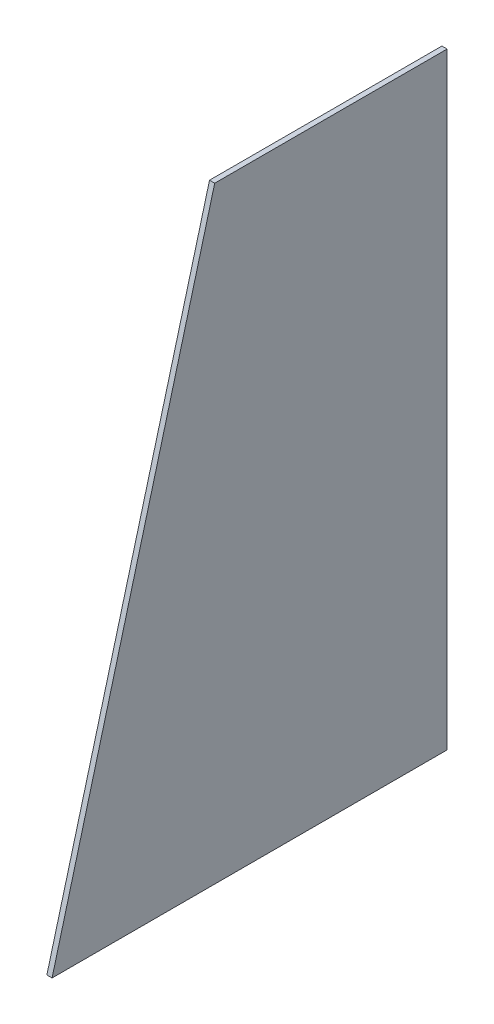
ISO-10303-21;
HEADER;
FILE_DESCRIPTION(('STEP AP214'),'2;1');
FILE_NAME('part.step','',(''),(''),'','','');
FILE_SCHEMA(('AUTOMOTIVE_DESIGN { 1 0 10303 214 1 1 1 1 }'));
ENDSEC;
DATA;
#1=APPLICATION_CONTEXT('core data for automotive mechanical design processes');
#2=APPLICATION_PROTOCOL_DEFINITION('international standard','automotive_design',2000,#1);
#3=PRODUCT_CONTEXT('',#1,'mechanical');
#4=PRODUCT('Part','Part','',(#3));
#5=PRODUCT_RELATED_PRODUCT_CATEGORY('part','',(#4));
#6=PRODUCT_DEFINITION_FORMATION('','',#4);
#7=PRODUCT_DEFINITION_CONTEXT('part definition',#1,'design');
#8=PRODUCT_DEFINITION('design','',#6,#7);
#9=PRODUCT_DEFINITION_SHAPE('','',#8);
#10=(LENGTH_UNIT() NAMED_UNIT(*) SI_UNIT(.MILLI.,.METRE.));
#11=(NAMED_UNIT(*) PLANE_ANGLE_UNIT() SI_UNIT($,.RADIAN.));
#12=(NAMED_UNIT(*) SI_UNIT($,.STERADIAN.) SOLID_ANGLE_UNIT());
#13=UNCERTAINTY_MEASURE_WITH_UNIT(LENGTH_MEASURE(1.E-05),#10,'distance_accuracy_value','');
#14=(GEOMETRIC_REPRESENTATION_CONTEXT(3) GLOBAL_UNCERTAINTY_ASSIGNED_CONTEXT((#13)) GLOBAL_UNIT_ASSIGNED_CONTEXT((#10,
#11,#12)) REPRESENTATION_CONTEXT('',''));
#15=CARTESIAN_POINT('',(0.,0.,0.));
#16=DIRECTION('',(0.,0.,1.));
#17=DIRECTION('',(1.,0.,0.));
#18=AXIS2_PLACEMENT_3D('',#15,#16,#17);
#19=CARTESIAN_POINT('',(3.,-175.205305412168,114.036597543577));
#20=DIRECTION('',(0.,-0.258819045102525,-0.965925826289067));
#21=DIRECTION('',(0.,0.965925826289067,-0.258819045102525));
#22=AXIS2_PLACEMENT_3D('',#19,#20,#21);
#23=PLANE('',#22);
#24=DIRECTION('',(0.,-0.965925826289067,0.258819045102525));
#25=VECTOR('',#24,1.);
#26=CARTESIAN_POINT('',(0.,-175.205305412168,114.036597543577));
#27=LINE('',#26,#25);
#28=CARTESIAN_POINT('',(0.,175.205305412168,20.1443573538982));
#29=VERTEX_POINT('',#28);
#30=CARTESIAN_POINT('',(0.,-175.205305412168,114.036597543577));
#31=VERTEX_POINT('',#30);
#32=EDGE_CURVE('E97',#29,#31,#27,.T.);
#33=ORIENTED_EDGE('',*,*,#32,.T.);
#34=DIRECTION('',(-1.,0.,0.));
#35=VECTOR('',#34,1.);
#36=CARTESIAN_POINT('',(3.,-175.205305412168,114.036597543577));
#37=LINE('',#36,#35);
#38=CARTESIAN_POINT('',(3.,-175.205305412168,114.036597543577));
#39=VERTEX_POINT('',#38);
#40=EDGE_CURVE('E11',#39,#31,#37,.T.);
#41=ORIENTED_EDGE('',*,*,#40,.F.);
#42=DIRECTION('',(0.,-0.965925826289067,0.258819045102525));
#43=VECTOR('',#42,1.);
#44=CARTESIAN_POINT('',(3.,-175.205305412168,114.036597543577));
#45=LINE('',#44,#43);
#46=CARTESIAN_POINT('',(3.,175.205305412168,20.1443573538982));
#47=VERTEX_POINT('',#46);
#48=EDGE_CURVE('E83',#47,#39,#45,.T.);
#49=ORIENTED_EDGE('',*,*,#48,.F.);
#50=DIRECTION('',(-1.,0.,0.));
#51=VECTOR('',#50,1.);
#52=CARTESIAN_POINT('',(3.,175.205305412168,20.1443573538982));
#53=LINE('',#52,#51);
#54=EDGE_CURVE('E93',#47,#29,#53,.T.);
#55=ORIENTED_EDGE('',*,*,#54,.T.);
#56=EDGE_LOOP('',(#33,#41,#49,#55));
#57=FACE_BOUND('',#56,.T.);
#58=ADVANCED_FACE('F33',(#57),#23,.F.);
#59=CARTESIAN_POINT('',(3.,-175.205305412168,-114.036597543577));
#60=DIRECTION('',(0.,1.,0.));
#61=DIRECTION('',(0.,0.,1.));
#62=AXIS2_PLACEMENT_3D('',#59,#60,#61);
#63=PLANE('',#62);
#64=DIRECTION('',(0.,0.,-1.));
#65=VECTOR('',#64,1.);
#66=CARTESIAN_POINT('',(0.,-175.205305412168,-114.036597543577));
#67=LINE('',#66,#65);
#68=CARTESIAN_POINT('',(0.,-175.205305412168,-114.036597543577));
#69=VERTEX_POINT('',#68);
#70=EDGE_CURVE('E88',#31,#69,#67,.T.);
#71=ORIENTED_EDGE('',*,*,#70,.T.);
#72=DIRECTION('',(-1.,0.,0.));
#73=VECTOR('',#72,1.);
#74=CARTESIAN_POINT('',(3.,-175.205305412168,-114.036597543577));
#75=LINE('',#74,#73);
#76=CARTESIAN_POINT('',(3.,-175.205305412168,-114.036597543577));
#77=VERTEX_POINT('',#76);
#78=EDGE_CURVE('E41',#77,#69,#75,.T.);
#79=ORIENTED_EDGE('',*,*,#78,.F.);
#80=DIRECTION('',(0.,0.,-1.));
#81=VECTOR('',#80,1.);
#82=CARTESIAN_POINT('',(3.,-175.205305412168,-111.036597543577));
#83=LINE('',#82,#81);
#84=EDGE_CURVE('E77',#39,#77,#83,.T.);
#85=ORIENTED_EDGE('',*,*,#84,.F.);
#86=ORIENTED_EDGE('',*,*,#40,.T.);
#87=EDGE_LOOP('',(#71,#79,#85,#86));
#88=FACE_BOUND('',#87,.T.);
#89=ADVANCED_FACE('F87',(#88),#63,.F.);
#90=CARTESIAN_POINT('',(3.,175.205305412168,-114.036597543577));
#91=DIRECTION('',(0.,0.,1.));
#92=DIRECTION('',(1.,0.,0.));
#93=AXIS2_PLACEMENT_3D('',#90,#91,#92);
#94=PLANE('',#93);
#95=DIRECTION('',(0.,1.,0.));
#96=VECTOR('',#95,1.);
#97=CARTESIAN_POINT('',(0.,175.205305412168,-114.036597543577));
#98=LINE('',#97,#96);
#99=CARTESIAN_POINT('',(0.,175.205305412168,-114.036597543577));
#100=VERTEX_POINT('',#99);
#101=EDGE_CURVE('E101',#69,#100,#98,.T.);
#102=ORIENTED_EDGE('',*,*,#101,.T.);
#103=DIRECTION('',(-1.,0.,0.));
#104=VECTOR('',#103,1.);
#105=CARTESIAN_POINT('',(3.,175.205305412168,-114.036597543577));
#106=LINE('',#105,#104);
#107=CARTESIAN_POINT('',(3.,175.205305412168,-114.036597543577));
#108=VERTEX_POINT('',#107);
#109=EDGE_CURVE('E90',#108,#100,#106,.T.);
#110=ORIENTED_EDGE('',*,*,#109,.F.);
#111=DIRECTION('',(0.,1.,0.));
#112=VECTOR('',#111,1.);
#113=CARTESIAN_POINT('',(3.,175.205305412168,-114.036597543577));
#114=LINE('',#113,#112);
#115=EDGE_CURVE('E80',#77,#108,#114,.T.);
#116=ORIENTED_EDGE('',*,*,#115,.F.);
#117=ORIENTED_EDGE('',*,*,#78,.T.);
#118=EDGE_LOOP('',(#102,#110,#116,#117));
#119=FACE_BOUND('',#118,.T.);
#120=ADVANCED_FACE('F91',(#119),#94,.F.);
#121=CARTESIAN_POINT('',(3.,175.205305412168,20.1443573538982));
#122=DIRECTION('',(0.,-1.,0.));
#123=DIRECTION('',(0.,0.,-1.));
#124=AXIS2_PLACEMENT_3D('',#121,#122,#123);
#125=PLANE('',#124);
#126=DIRECTION('',(0.,0.,1.));
#127=VECTOR('',#126,1.);
#128=CARTESIAN_POINT('',(0.,175.205305412168,20.1443573538982));
#129=LINE('',#128,#127);
#130=EDGE_CURVE('E66',#100,#29,#129,.T.);
#131=ORIENTED_EDGE('',*,*,#130,.T.);
#132=ORIENTED_EDGE('',*,*,#54,.F.);
#133=DIRECTION('',(0.,0.,1.));
#134=VECTOR('',#133,1.);
#135=CARTESIAN_POINT('',(3.,175.205305412168,-111.036597543577));
#136=LINE('',#135,#134);
#137=EDGE_CURVE('E49',#108,#47,#136,.T.);
#138=ORIENTED_EDGE('',*,*,#137,.F.);
#139=ORIENTED_EDGE('',*,*,#109,.T.);
#140=EDGE_LOOP('',(#131,#132,#138,#139));
#141=FACE_BOUND('',#140,.T.);
#142=ADVANCED_FACE('F105',(#141),#125,.F.);
#143=CARTESIAN_POINT('',(3.,0.,0.));
#144=DIRECTION('',(-1.,0.,0.));
#145=DIRECTION('',(0.,0.,1.));
#146=AXIS2_PLACEMENT_3D('',#143,#144,#145);
#147=PLANE('',#146);
#148=ORIENTED_EDGE('',*,*,#48,.T.);
#149=ORIENTED_EDGE('',*,*,#84,.T.);
#150=ORIENTED_EDGE('',*,*,#115,.T.);
#151=ORIENTED_EDGE('',*,*,#137,.T.);
#152=EDGE_LOOP('',(#148,#149,#150,#151));
#153=FACE_BOUND('',#152,.T.);
#154=ADVANCED_FACE('F78',(#153),#147,.F.);
#155=CARTESIAN_POINT('',(0.,0.,0.));
#156=DIRECTION('',(-1.,0.,0.));
#157=DIRECTION('',(0.,0.,1.));
#158=AXIS2_PLACEMENT_3D('',#155,#156,#157);
#159=PLANE('',#158);
#160=ORIENTED_EDGE('',*,*,#32,.F.);
#161=ORIENTED_EDGE('',*,*,#130,.F.);
#162=ORIENTED_EDGE('',*,*,#101,.F.);
#163=ORIENTED_EDGE('',*,*,#70,.F.);
#164=EDGE_LOOP('',(#160,#161,#162,#163));
#165=FACE_BOUND('',#164,.T.);
#166=ADVANCED_FACE('F107',(#165),#159,.T.);
#167=CLOSED_SHELL('',(#58,#89,#120,#142,#154,#166));
#168=MANIFOLD_SOLID_BREP('B2',#167);
#169=ADVANCED_BREP_SHAPE_REPRESENTATION('',(#18,#168),#14);
#170=SHAPE_DEFINITION_REPRESENTATION(#9,#169);
ENDSEC;
END-ISO-10303-21;
